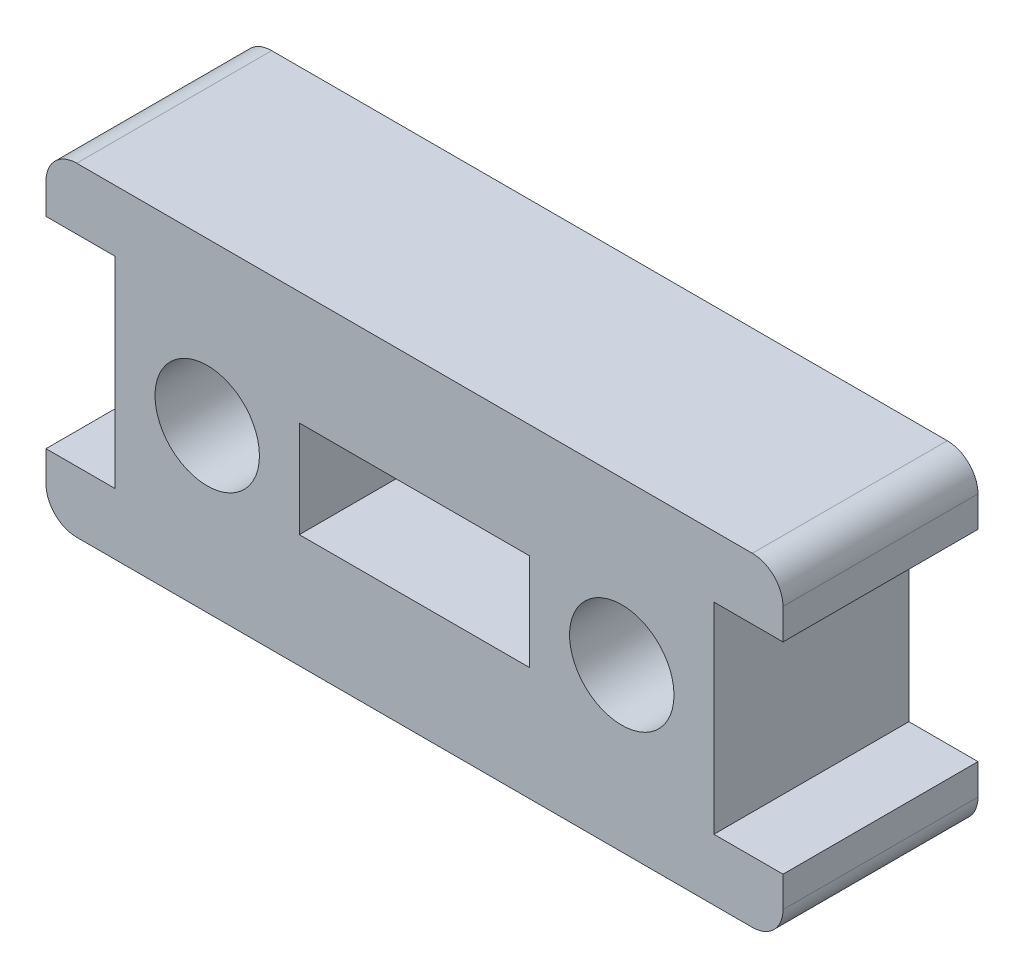
ISO-10303-21;
HEADER;
FILE_DESCRIPTION(('STEP AP214'),'2;1');
FILE_NAME('part.step','',(''),(''),'','','');
FILE_SCHEMA(('AUTOMOTIVE_DESIGN { 1 0 10303 214 1 1 1 1 }'));
ENDSEC;
DATA;
#1=APPLICATION_CONTEXT('core data for automotive mechanical design processes');
#2=APPLICATION_PROTOCOL_DEFINITION('international standard','automotive_design',2000,#1);
#3=PRODUCT_CONTEXT('',#1,'mechanical');
#4=PRODUCT('Part','Part','',(#3));
#5=PRODUCT_RELATED_PRODUCT_CATEGORY('part','',(#4));
#6=PRODUCT_DEFINITION_FORMATION('','',#4);
#7=PRODUCT_DEFINITION_CONTEXT('part definition',#1,'design');
#8=PRODUCT_DEFINITION('design','',#6,#7);
#9=PRODUCT_DEFINITION_SHAPE('','',#8);
#10=(LENGTH_UNIT() NAMED_UNIT(*) SI_UNIT(.MILLI.,.METRE.));
#11=(NAMED_UNIT(*) PLANE_ANGLE_UNIT() SI_UNIT($,.RADIAN.));
#12=(NAMED_UNIT(*) SI_UNIT($,.STERADIAN.) SOLID_ANGLE_UNIT());
#13=UNCERTAINTY_MEASURE_WITH_UNIT(LENGTH_MEASURE(1.E-05),#10,'distance_accuracy_value','');
#14=(GEOMETRIC_REPRESENTATION_CONTEXT(3) GLOBAL_UNCERTAINTY_ASSIGNED_CONTEXT((#13)) GLOBAL_UNIT_ASSIGNED_CONTEXT((#10,
#11,#12)) REPRESENTATION_CONTEXT('',''));
#15=CARTESIAN_POINT('',(0.,0.,0.));
#16=DIRECTION('',(0.,0.,1.));
#17=DIRECTION('',(1.,0.,0.));
#18=AXIS2_PLACEMENT_3D('',#15,#16,#17);
#19=CARTESIAN_POINT('',(0.,0.,6.35));
#20=DIRECTION('',(0.,0.,-1.));
#21=DIRECTION('',(-1.,0.,0.));
#22=AXIS2_PLACEMENT_3D('',#19,#20,#21);
#23=PLANE('',#22);
#24=CARTESIAN_POINT('',(-6.75,0.,6.35));
#25=DIRECTION('',(0.,0.,1.));
#26=DIRECTION('',(1.,0.,0.));
#27=AXIS2_PLACEMENT_3D('',#24,#25,#26);
#28=CIRCLE('',#27,1.7);
#29=CARTESIAN_POINT('',(-5.05,0.,6.35));
#30=VERTEX_POINT('',#29);
#31=EDGE_CURVE('E557',#30,#30,#28,.T.);
#32=ORIENTED_EDGE('',*,*,#31,.F.);
#33=EDGE_LOOP('',(#32));
#34=FACE_BOUND('',#33,.T.);
#35=CARTESIAN_POINT('',(6.75,0.,6.35));
#36=DIRECTION('',(0.,0.,1.));
#37=DIRECTION('',(1.,0.,0.));
#38=AXIS2_PLACEMENT_3D('',#35,#36,#37);
#39=CIRCLE('',#38,1.7);
#40=CARTESIAN_POINT('',(8.45,0.,6.35));
#41=VERTEX_POINT('',#40);
#42=EDGE_CURVE('E559',#41,#41,#39,.T.);
#43=ORIENTED_EDGE('',*,*,#42,.F.);
#44=EDGE_LOOP('',(#43));
#45=FACE_BOUND('',#44,.T.);
#46=DIRECTION('',(0.,-1.,0.));
#47=VECTOR('',#46,1.);
#48=CARTESIAN_POINT('',(-12.,-3.275,6.35));
#49=LINE('',#48,#47);
#50=CARTESIAN_POINT('',(-12.,-3.275,6.35));
#51=VERTEX_POINT('',#50);
#52=CARTESIAN_POINT('',(-12.,-4.275,6.35));
#53=VERTEX_POINT('',#52);
#54=EDGE_CURVE('E222',#51,#53,#49,.T.);
#55=ORIENTED_EDGE('',*,*,#54,.T.);
#56=CARTESIAN_POINT('',(-11.,-4.275,6.35));
#57=DIRECTION('',(0.,0.,-1.));
#58=DIRECTION('',(-1.,0.,0.));
#59=AXIS2_PLACEMENT_3D('',#56,#57,#58);
#60=CIRCLE('',#59,1.);
#61=CARTESIAN_POINT('',(-11.,-5.275,6.35));
#62=VERTEX_POINT('',#61);
#63=EDGE_CURVE('E315',#53,#62,#60,.F.);
#64=ORIENTED_EDGE('',*,*,#63,.T.);
#65=DIRECTION('',(1.,0.,0.));
#66=VECTOR('',#65,1.);
#67=CARTESIAN_POINT('',(-12.,-5.275,6.35));
#68=LINE('',#67,#66);
#69=CARTESIAN_POINT('',(11.,-5.275,6.35));
#70=VERTEX_POINT('',#69);
#71=EDGE_CURVE('E225',#62,#70,#68,.T.);
#72=ORIENTED_EDGE('',*,*,#71,.T.);
#73=CARTESIAN_POINT('',(11.,-4.275,6.35));
#74=DIRECTION('',(0.,0.,-1.));
#75=DIRECTION('',(-1.,0.,0.));
#76=AXIS2_PLACEMENT_3D('',#73,#74,#75);
#77=CIRCLE('',#76,1.);
#78=CARTESIAN_POINT('',(12.,-4.275,6.35));
#79=VERTEX_POINT('',#78);
#80=EDGE_CURVE('E313',#70,#79,#77,.F.);
#81=ORIENTED_EDGE('',*,*,#80,.T.);
#82=DIRECTION('',(0.,1.,0.));
#83=VECTOR('',#82,1.);
#84=CARTESIAN_POINT('',(12.,-3.275,6.35));
#85=LINE('',#84,#83);
#86=CARTESIAN_POINT('',(12.,-3.275,6.35));
#87=VERTEX_POINT('',#86);
#88=EDGE_CURVE('E228',#79,#87,#85,.T.);
#89=ORIENTED_EDGE('',*,*,#88,.T.);
#90=DIRECTION('',(-1.,0.,0.));
#91=VECTOR('',#90,1.);
#92=CARTESIAN_POINT('',(9.75,-3.275,6.35));
#93=LINE('',#92,#91);
#94=CARTESIAN_POINT('',(9.75,-3.275,6.35));
#95=VERTEX_POINT('',#94);
#96=EDGE_CURVE('E230',#87,#95,#93,.T.);
#97=ORIENTED_EDGE('',*,*,#96,.T.);
#98=DIRECTION('',(0.,1.,0.));
#99=VECTOR('',#98,1.);
#100=CARTESIAN_POINT('',(9.75,3.275,6.35));
#101=LINE('',#100,#99);
#102=CARTESIAN_POINT('',(9.75,3.275,6.35));
#103=VERTEX_POINT('',#102);
#104=EDGE_CURVE('E232',#95,#103,#101,.T.);
#105=ORIENTED_EDGE('',*,*,#104,.T.);
#106=DIRECTION('',(1.,0.,0.));
#107=VECTOR('',#106,1.);
#108=CARTESIAN_POINT('',(12.,3.275,6.35));
#109=LINE('',#108,#107);
#110=CARTESIAN_POINT('',(12.,3.275,6.35));
#111=VERTEX_POINT('',#110);
#112=EDGE_CURVE('E234',#103,#111,#109,.T.);
#113=ORIENTED_EDGE('',*,*,#112,.T.);
#114=DIRECTION('',(0.,1.,0.));
#115=VECTOR('',#114,1.);
#116=CARTESIAN_POINT('',(12.,3.275,6.35));
#117=LINE('',#116,#115);
#118=CARTESIAN_POINT('',(12.,4.275,6.35));
#119=VERTEX_POINT('',#118);
#120=EDGE_CURVE('E236',#111,#119,#117,.T.);
#121=ORIENTED_EDGE('',*,*,#120,.T.);
#122=CARTESIAN_POINT('',(11.,4.275,6.35));
#123=DIRECTION('',(0.,0.,-1.));
#124=DIRECTION('',(-1.,0.,0.));
#125=AXIS2_PLACEMENT_3D('',#122,#123,#124);
#126=CIRCLE('',#125,1.);
#127=CARTESIAN_POINT('',(11.,5.275,6.35));
#128=VERTEX_POINT('',#127);
#129=EDGE_CURVE('E311',#119,#128,#126,.F.);
#130=ORIENTED_EDGE('',*,*,#129,.T.);
#131=DIRECTION('',(-1.,0.,0.));
#132=VECTOR('',#131,1.);
#133=CARTESIAN_POINT('',(-12.,5.275,6.35));
#134=LINE('',#133,#132);
#135=CARTESIAN_POINT('',(-11.,5.275,6.35));
#136=VERTEX_POINT('',#135);
#137=EDGE_CURVE('E239',#128,#136,#134,.T.);
#138=ORIENTED_EDGE('',*,*,#137,.T.);
#139=CARTESIAN_POINT('',(-11.,4.275,6.35));
#140=DIRECTION('',(0.,0.,-1.));
#141=DIRECTION('',(-1.,0.,0.));
#142=AXIS2_PLACEMENT_3D('',#139,#140,#141);
#143=CIRCLE('',#142,1.);
#144=CARTESIAN_POINT('',(-12.,4.275,6.35));
#145=VERTEX_POINT('',#144);
#146=EDGE_CURVE('E48',#136,#145,#143,.F.);
#147=ORIENTED_EDGE('',*,*,#146,.T.);
#148=DIRECTION('',(0.,-1.,0.));
#149=VECTOR('',#148,1.);
#150=CARTESIAN_POINT('',(-12.,3.275,6.35));
#151=LINE('',#150,#149);
#152=CARTESIAN_POINT('',(-12.,3.275,6.35));
#153=VERTEX_POINT('',#152);
#154=EDGE_CURVE('E241',#145,#153,#151,.T.);
#155=ORIENTED_EDGE('',*,*,#154,.T.);
#156=DIRECTION('',(1.,0.,0.));
#157=VECTOR('',#156,1.);
#158=CARTESIAN_POINT('',(-12.,3.275,6.35));
#159=LINE('',#158,#157);
#160=CARTESIAN_POINT('',(-9.75,3.275,6.35));
#161=VERTEX_POINT('',#160);
#162=EDGE_CURVE('E243',#153,#161,#159,.T.);
#163=ORIENTED_EDGE('',*,*,#162,.T.);
#164=DIRECTION('',(0.,-1.,0.));
#165=VECTOR('',#164,1.);
#166=CARTESIAN_POINT('',(-9.75,3.275,6.35));
#167=LINE('',#166,#165);
#168=CARTESIAN_POINT('',(-9.75,-3.275,6.35));
#169=VERTEX_POINT('',#168);
#170=EDGE_CURVE('E216',#161,#169,#167,.T.);
#171=ORIENTED_EDGE('',*,*,#170,.T.);
#172=DIRECTION('',(-1.,0.,0.));
#173=VECTOR('',#172,1.);
#174=CARTESIAN_POINT('',(-9.75,-3.275,6.35));
#175=LINE('',#174,#173);
#176=EDGE_CURVE('E219',#169,#51,#175,.T.);
#177=ORIENTED_EDGE('',*,*,#176,.T.);
#178=EDGE_LOOP('',(#55,#64,#72,#81,#89,#97,#105,#113,#121,#130,#138,#147,#155,#163,#171,#177));
#179=FACE_BOUND('',#178,.T.);
#180=DIRECTION('',(0.,-1.,0.));
#181=VECTOR('',#180,1.);
#182=CARTESIAN_POINT('',(-3.75,-1.575,6.35));
#183=LINE('',#182,#181);
#184=CARTESIAN_POINT('',(-3.75,1.575,6.35));
#185=VERTEX_POINT('',#184);
#186=CARTESIAN_POINT('',(-3.75,-1.575,6.35));
#187=VERTEX_POINT('',#186);
#188=EDGE_CURVE('E173',#185,#187,#183,.T.);
#189=ORIENTED_EDGE('',*,*,#188,.F.);
#190=DIRECTION('',(-1.,0.,0.));
#191=VECTOR('',#190,1.);
#192=CARTESIAN_POINT('',(3.75,1.575,6.35));
#193=LINE('',#192,#191);
#194=CARTESIAN_POINT('',(3.75,1.575,6.35));
#195=VERTEX_POINT('',#194);
#196=EDGE_CURVE('E198',#195,#185,#193,.T.);
#197=ORIENTED_EDGE('',*,*,#196,.F.);
#198=DIRECTION('',(0.,1.,0.));
#199=VECTOR('',#198,1.);
#200=CARTESIAN_POINT('',(3.75,-1.575,6.35));
#201=LINE('',#200,#199);
#202=CARTESIAN_POINT('',(3.75,-1.575,6.35));
#203=VERTEX_POINT('',#202);
#204=EDGE_CURVE('E196',#203,#195,#201,.T.);
#205=ORIENTED_EDGE('',*,*,#204,.F.);
#206=DIRECTION('',(1.,0.,0.));
#207=VECTOR('',#206,1.);
#208=CARTESIAN_POINT('',(3.75,-1.575,6.35));
#209=LINE('',#208,#207);
#210=EDGE_CURVE('E183',#187,#203,#209,.T.);
#211=ORIENTED_EDGE('',*,*,#210,.F.);
#212=EDGE_LOOP('',(#189,#197,#205,#211));
#213=FACE_BOUND('',#212,.T.);
#214=ADVANCED_FACE('F33',(#34,#45,#179,#213),#23,.F.);
#215=CARTESIAN_POINT('',(0.,0.,0.));
#216=DIRECTION('',(0.,0.,-1.));
#217=DIRECTION('',(-1.,0.,0.));
#218=AXIS2_PLACEMENT_3D('',#215,#216,#217);
#219=PLANE('',#218);
#220=CARTESIAN_POINT('',(-6.75,0.,0.));
#221=DIRECTION('',(0.,0.,1.));
#222=DIRECTION('',(1.,0.,0.));
#223=AXIS2_PLACEMENT_3D('',#220,#221,#222);
#224=CIRCLE('',#223,1.7);
#225=CARTESIAN_POINT('',(-5.05,0.,0.));
#226=VERTEX_POINT('',#225);
#227=EDGE_CURVE('E555',#226,#226,#224,.T.);
#228=ORIENTED_EDGE('',*,*,#227,.T.);
#229=EDGE_LOOP('',(#228));
#230=FACE_BOUND('',#229,.T.);
#231=CARTESIAN_POINT('',(6.75,0.,0.));
#232=DIRECTION('',(0.,0.,1.));
#233=DIRECTION('',(1.,0.,0.));
#234=AXIS2_PLACEMENT_3D('',#231,#232,#233);
#235=CIRCLE('',#234,1.7);
#236=CARTESIAN_POINT('',(8.45,0.,0.));
#237=VERTEX_POINT('',#236);
#238=EDGE_CURVE('E205',#237,#237,#235,.T.);
#239=ORIENTED_EDGE('',*,*,#238,.T.);
#240=EDGE_LOOP('',(#239));
#241=FACE_BOUND('',#240,.T.);
#242=DIRECTION('',(1.,0.,0.));
#243=VECTOR('',#242,1.);
#244=CARTESIAN_POINT('',(-12.,-5.275,0.));
#245=LINE('',#244,#243);
#246=CARTESIAN_POINT('',(-11.,-5.275,0.));
#247=VERTEX_POINT('',#246);
#248=CARTESIAN_POINT('',(11.,-5.275,0.));
#249=VERTEX_POINT('',#248);
#250=EDGE_CURVE('E253',#247,#249,#245,.T.);
#251=ORIENTED_EDGE('',*,*,#250,.F.);
#252=CARTESIAN_POINT('',(-11.,-4.275,0.));
#253=DIRECTION('',(0.,0.,-1.));
#254=DIRECTION('',(-1.,0.,0.));
#255=AXIS2_PLACEMENT_3D('',#252,#253,#254);
#256=CIRCLE('',#255,1.);
#257=CARTESIAN_POINT('',(-12.,-4.275,0.));
#258=VERTEX_POINT('',#257);
#259=EDGE_CURVE('E306',#247,#258,#256,.T.);
#260=ORIENTED_EDGE('',*,*,#259,.T.);
#261=DIRECTION('',(0.,-1.,0.));
#262=VECTOR('',#261,1.);
#263=CARTESIAN_POINT('',(-12.,-3.275,0.));
#264=LINE('',#263,#262);
#265=CARTESIAN_POINT('',(-12.,-3.275,0.));
#266=VERTEX_POINT('',#265);
#267=EDGE_CURVE('E250',#266,#258,#264,.T.);
#268=ORIENTED_EDGE('',*,*,#267,.F.);
#269=DIRECTION('',(-1.,0.,0.));
#270=VECTOR('',#269,1.);
#271=CARTESIAN_POINT('',(-9.75,-3.275,0.));
#272=LINE('',#271,#270);
#273=CARTESIAN_POINT('',(-9.75,-3.275,0.));
#274=VERTEX_POINT('',#273);
#275=EDGE_CURVE('E248',#274,#266,#272,.T.);
#276=ORIENTED_EDGE('',*,*,#275,.F.);
#277=DIRECTION('',(0.,-1.,0.));
#278=VECTOR('',#277,1.);
#279=CARTESIAN_POINT('',(-9.75,3.275,0.));
#280=LINE('',#279,#278);
#281=CARTESIAN_POINT('',(-9.75,3.275,0.));
#282=VERTEX_POINT('',#281);
#283=EDGE_CURVE('E191',#282,#274,#280,.T.);
#284=ORIENTED_EDGE('',*,*,#283,.F.);
#285=DIRECTION('',(1.,0.,0.));
#286=VECTOR('',#285,1.);
#287=CARTESIAN_POINT('',(-12.,3.275,0.));
#288=LINE('',#287,#286);
#289=CARTESIAN_POINT('',(-12.,3.275,0.));
#290=VERTEX_POINT('',#289);
#291=EDGE_CURVE('E220',#290,#282,#288,.T.);
#292=ORIENTED_EDGE('',*,*,#291,.F.);
#293=DIRECTION('',(0.,-1.,0.));
#294=VECTOR('',#293,1.);
#295=CARTESIAN_POINT('',(-12.,3.275,0.));
#296=LINE('',#295,#294);
#297=CARTESIAN_POINT('',(-12.,4.275,0.));
#298=VERTEX_POINT('',#297);
#299=EDGE_CURVE('E269',#298,#290,#296,.T.);
#300=ORIENTED_EDGE('',*,*,#299,.F.);
#301=CARTESIAN_POINT('',(-11.,4.275,0.));
#302=DIRECTION('',(0.,0.,-1.));
#303=DIRECTION('',(-1.,0.,0.));
#304=AXIS2_PLACEMENT_3D('',#301,#302,#303);
#305=CIRCLE('',#304,1.);
#306=CARTESIAN_POINT('',(-11.,5.275,0.));
#307=VERTEX_POINT('',#306);
#308=EDGE_CURVE('E300',#298,#307,#305,.T.);
#309=ORIENTED_EDGE('',*,*,#308,.T.);
#310=DIRECTION('',(-1.,0.,0.));
#311=VECTOR('',#310,1.);
#312=CARTESIAN_POINT('',(-12.,5.275,0.));
#313=LINE('',#312,#311);
#314=CARTESIAN_POINT('',(11.,5.275,0.));
#315=VERTEX_POINT('',#314);
#316=EDGE_CURVE('E267',#315,#307,#313,.T.);
#317=ORIENTED_EDGE('',*,*,#316,.F.);
#318=CARTESIAN_POINT('',(11.,4.275,0.));
#319=DIRECTION('',(0.,0.,-1.));
#320=DIRECTION('',(-1.,0.,0.));
#321=AXIS2_PLACEMENT_3D('',#318,#319,#320);
#322=CIRCLE('',#321,1.);
#323=CARTESIAN_POINT('',(12.,4.275,0.));
#324=VERTEX_POINT('',#323);
#325=EDGE_CURVE('E302',#315,#324,#322,.T.);
#326=ORIENTED_EDGE('',*,*,#325,.T.);
#327=DIRECTION('',(0.,1.,0.));
#328=VECTOR('',#327,1.);
#329=CARTESIAN_POINT('',(12.,3.275,0.));
#330=LINE('',#329,#328);
#331=CARTESIAN_POINT('',(12.,3.275,0.));
#332=VERTEX_POINT('',#331);
#333=EDGE_CURVE('E264',#332,#324,#330,.T.);
#334=ORIENTED_EDGE('',*,*,#333,.F.);
#335=DIRECTION('',(1.,0.,0.));
#336=VECTOR('',#335,1.);
#337=CARTESIAN_POINT('',(12.,3.275,0.));
#338=LINE('',#337,#336);
#339=CARTESIAN_POINT('',(9.75,3.275,0.));
#340=VERTEX_POINT('',#339);
#341=EDGE_CURVE('E262',#340,#332,#338,.T.);
#342=ORIENTED_EDGE('',*,*,#341,.F.);
#343=DIRECTION('',(0.,1.,0.));
#344=VECTOR('',#343,1.);
#345=CARTESIAN_POINT('',(9.75,3.275,0.));
#346=LINE('',#345,#344);
#347=CARTESIAN_POINT('',(9.75,-3.275,0.));
#348=VERTEX_POINT('',#347);
#349=EDGE_CURVE('E260',#348,#340,#346,.T.);
#350=ORIENTED_EDGE('',*,*,#349,.F.);
#351=DIRECTION('',(-1.,0.,0.));
#352=VECTOR('',#351,1.);
#353=CARTESIAN_POINT('',(9.75,-3.275,0.));
#354=LINE('',#353,#352);
#355=CARTESIAN_POINT('',(12.,-3.275,0.));
#356=VERTEX_POINT('',#355);
#357=EDGE_CURVE('E258',#356,#348,#354,.T.);
#358=ORIENTED_EDGE('',*,*,#357,.F.);
#359=DIRECTION('',(0.,1.,0.));
#360=VECTOR('',#359,1.);
#361=CARTESIAN_POINT('',(12.,-3.275,0.));
#362=LINE('',#361,#360);
#363=CARTESIAN_POINT('',(12.,-4.275,0.));
#364=VERTEX_POINT('',#363);
#365=EDGE_CURVE('E256',#364,#356,#362,.T.);
#366=ORIENTED_EDGE('',*,*,#365,.F.);
#367=CARTESIAN_POINT('',(11.,-4.275,0.));
#368=DIRECTION('',(0.,0.,-1.));
#369=DIRECTION('',(-1.,0.,0.));
#370=AXIS2_PLACEMENT_3D('',#367,#368,#369);
#371=CIRCLE('',#370,1.);
#372=EDGE_CURVE('E304',#364,#249,#371,.T.);
#373=ORIENTED_EDGE('',*,*,#372,.T.);
#374=EDGE_LOOP('',(#251,#260,#268,#276,#284,#292,#300,#309,#317,#326,#334,#342,#350,#358,#366,#373));
#375=FACE_BOUND('',#374,.T.);
#376=DIRECTION('',(-1.,0.,0.));
#377=VECTOR('',#376,1.);
#378=CARTESIAN_POINT('',(3.75,1.575,0.));
#379=LINE('',#378,#377);
#380=CARTESIAN_POINT('',(3.75,1.575,0.));
#381=VERTEX_POINT('',#380);
#382=CARTESIAN_POINT('',(-3.75,1.575,0.));
#383=VERTEX_POINT('',#382);
#384=EDGE_CURVE('E184',#381,#383,#379,.T.);
#385=ORIENTED_EDGE('',*,*,#384,.T.);
#386=DIRECTION('',(0.,-1.,0.));
#387=VECTOR('',#386,1.);
#388=CARTESIAN_POINT('',(-3.75,-1.575,0.));
#389=LINE('',#388,#387);
#390=CARTESIAN_POINT('',(-3.75,-1.575,0.));
#391=VERTEX_POINT('',#390);
#392=EDGE_CURVE('E203',#383,#391,#389,.T.);
#393=ORIENTED_EDGE('',*,*,#392,.T.);
#394=DIRECTION('',(1.,0.,0.));
#395=VECTOR('',#394,1.);
#396=CARTESIAN_POINT('',(3.75,-1.575,0.));
#397=LINE('',#396,#395);
#398=CARTESIAN_POINT('',(3.75,-1.575,0.));
#399=VERTEX_POINT('',#398);
#400=EDGE_CURVE('E190',#391,#399,#397,.T.);
#401=ORIENTED_EDGE('',*,*,#400,.T.);
#402=DIRECTION('',(0.,1.,0.));
#403=VECTOR('',#402,1.);
#404=CARTESIAN_POINT('',(3.75,-1.575,0.));
#405=LINE('',#404,#403);
#406=EDGE_CURVE('E207',#399,#381,#405,.T.);
#407=ORIENTED_EDGE('',*,*,#406,.T.);
#408=EDGE_LOOP('',(#385,#393,#401,#407));
#409=FACE_BOUND('',#408,.T.);
#410=ADVANCED_FACE('F338',(#230,#241,#375,#409),#219,.T.);
#411=CARTESIAN_POINT('',(-9.75,3.275,6.35));
#412=DIRECTION('',(1.,0.,0.));
#413=DIRECTION('',(0.,0.,-1.));
#414=AXIS2_PLACEMENT_3D('',#411,#412,#413);
#415=PLANE('',#414);
#416=ORIENTED_EDGE('',*,*,#283,.T.);
#417=DIRECTION('',(0.,0.,-1.));
#418=VECTOR('',#417,1.);
#419=CARTESIAN_POINT('',(-9.75,-3.275,6.35));
#420=LINE('',#419,#418);
#421=EDGE_CURVE('E292',#169,#274,#420,.T.);
#422=ORIENTED_EDGE('',*,*,#421,.F.);
#423=ORIENTED_EDGE('',*,*,#170,.F.);
#424=DIRECTION('',(0.,0.,-1.));
#425=VECTOR('',#424,1.);
#426=CARTESIAN_POINT('',(-9.75,3.275,6.35));
#427=LINE('',#426,#425);
#428=EDGE_CURVE('E245',#161,#282,#427,.T.);
#429=ORIENTED_EDGE('',*,*,#428,.T.);
#430=EDGE_LOOP('',(#416,#422,#423,#429));
#431=FACE_BOUND('',#430,.T.);
#432=ADVANCED_FACE('F355',(#431),#415,.F.);
#433=CARTESIAN_POINT('',(-9.75,-3.275,6.35));
#434=DIRECTION('',(0.,-1.,0.));
#435=DIRECTION('',(1.,0.,0.));
#436=AXIS2_PLACEMENT_3D('',#433,#434,#435);
#437=PLANE('',#436);
#438=ORIENTED_EDGE('',*,*,#275,.T.);
#439=DIRECTION('',(0.,0.,-1.));
#440=VECTOR('',#439,1.);
#441=CARTESIAN_POINT('',(-12.,-3.275,6.35));
#442=LINE('',#441,#440);
#443=EDGE_CURVE('E289',#51,#266,#442,.T.);
#444=ORIENTED_EDGE('',*,*,#443,.F.);
#445=ORIENTED_EDGE('',*,*,#176,.F.);
#446=ORIENTED_EDGE('',*,*,#421,.T.);
#447=EDGE_LOOP('',(#438,#444,#445,#446));
#448=FACE_BOUND('',#447,.T.);
#449=ADVANCED_FACE('F357',(#448),#437,.F.);
#450=CARTESIAN_POINT('',(-12.,-3.275,6.35));
#451=DIRECTION('',(1.,0.,0.));
#452=DIRECTION('',(0.,1.,0.));
#453=AXIS2_PLACEMENT_3D('',#450,#451,#452);
#454=PLANE('',#453);
#455=ORIENTED_EDGE('',*,*,#267,.T.);
#456=DIRECTION('',(0.,0.,-1.));
#457=VECTOR('',#456,1.);
#458=CARTESIAN_POINT('',(-12.,-4.275,6.35));
#459=LINE('',#458,#457);
#460=EDGE_CURVE('E308',#258,#53,#459,.F.);
#461=ORIENTED_EDGE('',*,*,#460,.T.);
#462=ORIENTED_EDGE('',*,*,#54,.F.);
#463=ORIENTED_EDGE('',*,*,#443,.T.);
#464=EDGE_LOOP('',(#455,#461,#462,#463));
#465=FACE_BOUND('',#464,.T.);
#466=ADVANCED_FACE('F469',(#465),#454,.F.);
#467=CARTESIAN_POINT('',(-12.,-5.275,6.35));
#468=DIRECTION('',(0.,1.,0.));
#469=DIRECTION('',(-1.,0.,0.));
#470=AXIS2_PLACEMENT_3D('',#467,#468,#469);
#471=PLANE('',#470);
#472=ORIENTED_EDGE('',*,*,#71,.F.);
#473=DIRECTION('',(0.,0.,-1.));
#474=VECTOR('',#473,1.);
#475=CARTESIAN_POINT('',(-11.,-5.275,6.35));
#476=LINE('',#475,#474);
#477=EDGE_CURVE('E297',#62,#247,#476,.T.);
#478=ORIENTED_EDGE('',*,*,#477,.T.);
#479=ORIENTED_EDGE('',*,*,#250,.T.);
#480=DIRECTION('',(0.,0.,-1.));
#481=VECTOR('',#480,1.);
#482=CARTESIAN_POINT('',(11.,-5.275,6.35));
#483=LINE('',#482,#481);
#484=EDGE_CURVE('E295',#249,#70,#483,.F.);
#485=ORIENTED_EDGE('',*,*,#484,.T.);
#486=EDGE_LOOP('',(#472,#478,#479,#485));
#487=FACE_BOUND('',#486,.T.);
#488=ADVANCED_FACE('F368',(#487),#471,.F.);
#489=CARTESIAN_POINT('',(12.,-3.275,6.35));
#490=DIRECTION('',(-1.,0.,0.));
#491=DIRECTION('',(0.,0.,1.));
#492=AXIS2_PLACEMENT_3D('',#489,#490,#491);
#493=PLANE('',#492);
#494=ORIENTED_EDGE('',*,*,#88,.F.);
#495=DIRECTION('',(0.,0.,-1.));
#496=VECTOR('',#495,1.);
#497=CARTESIAN_POINT('',(12.,-4.275,6.35));
#498=LINE('',#497,#496);
#499=EDGE_CURVE('E317',#79,#364,#498,.T.);
#500=ORIENTED_EDGE('',*,*,#499,.T.);
#501=ORIENTED_EDGE('',*,*,#365,.T.);
#502=DIRECTION('',(0.,0.,-1.));
#503=VECTOR('',#502,1.);
#504=CARTESIAN_POINT('',(12.,-3.275,6.35));
#505=LINE('',#504,#503);
#506=EDGE_CURVE('E286',#87,#356,#505,.T.);
#507=ORIENTED_EDGE('',*,*,#506,.F.);
#508=EDGE_LOOP('',(#494,#500,#501,#507));
#509=FACE_BOUND('',#508,.T.);
#510=ADVANCED_FACE('F379',(#509),#493,.F.);
#511=CARTESIAN_POINT('',(9.75,-3.275,6.35));
#512=DIRECTION('',(0.,-1.,0.));
#513=DIRECTION('',(1.,0.,0.));
#514=AXIS2_PLACEMENT_3D('',#511,#512,#513);
#515=PLANE('',#514);
#516=ORIENTED_EDGE('',*,*,#357,.T.);
#517=DIRECTION('',(0.,0.,-1.));
#518=VECTOR('',#517,1.);
#519=CARTESIAN_POINT('',(9.75,-3.275,6.35));
#520=LINE('',#519,#518);
#521=EDGE_CURVE('E283',#95,#348,#520,.T.);
#522=ORIENTED_EDGE('',*,*,#521,.F.);
#523=ORIENTED_EDGE('',*,*,#96,.F.);
#524=ORIENTED_EDGE('',*,*,#506,.T.);
#525=EDGE_LOOP('',(#516,#522,#523,#524));
#526=FACE_BOUND('',#525,.T.);
#527=ADVANCED_FACE('F386',(#526),#515,.F.);
#528=CARTESIAN_POINT('',(9.75,3.275,6.35));
#529=DIRECTION('',(-1.,0.,0.));
#530=DIRECTION('',(0.,0.,1.));
#531=AXIS2_PLACEMENT_3D('',#528,#529,#530);
#532=PLANE('',#531);
#533=ORIENTED_EDGE('',*,*,#349,.T.);
#534=DIRECTION('',(0.,0.,-1.));
#535=VECTOR('',#534,1.);
#536=CARTESIAN_POINT('',(9.75,3.275,6.35));
#537=LINE('',#536,#535);
#538=EDGE_CURVE('E280',#103,#340,#537,.T.);
#539=ORIENTED_EDGE('',*,*,#538,.F.);
#540=ORIENTED_EDGE('',*,*,#104,.F.);
#541=ORIENTED_EDGE('',*,*,#521,.T.);
#542=EDGE_LOOP('',(#533,#539,#540,#541));
#543=FACE_BOUND('',#542,.T.);
#544=ADVANCED_FACE('F389',(#543),#532,.F.);
#545=CARTESIAN_POINT('',(12.,3.275,6.35));
#546=DIRECTION('',(0.,1.,0.));
#547=DIRECTION('',(0.,0.,1.));
#548=AXIS2_PLACEMENT_3D('',#545,#546,#547);
#549=PLANE('',#548);
#550=ORIENTED_EDGE('',*,*,#341,.T.);
#551=DIRECTION('',(0.,0.,-1.));
#552=VECTOR('',#551,1.);
#553=CARTESIAN_POINT('',(12.,3.275,6.35));
#554=LINE('',#553,#552);
#555=EDGE_CURVE('E277',#111,#332,#554,.T.);
#556=ORIENTED_EDGE('',*,*,#555,.F.);
#557=ORIENTED_EDGE('',*,*,#112,.F.);
#558=ORIENTED_EDGE('',*,*,#538,.T.);
#559=EDGE_LOOP('',(#550,#556,#557,#558));
#560=FACE_BOUND('',#559,.T.);
#561=ADVANCED_FACE('F392',(#560),#549,.F.);
#562=CARTESIAN_POINT('',(12.,3.275,6.35));
#563=DIRECTION('',(-1.,0.,0.));
#564=DIRECTION('',(0.,-1.,0.));
#565=AXIS2_PLACEMENT_3D('',#562,#563,#564);
#566=PLANE('',#565);
#567=ORIENTED_EDGE('',*,*,#333,.T.);
#568=DIRECTION('',(0.,0.,-1.));
#569=VECTOR('',#568,1.);
#570=CARTESIAN_POINT('',(12.,4.275,6.35));
#571=LINE('',#570,#569);
#572=EDGE_CURVE('E41',#324,#119,#571,.F.);
#573=ORIENTED_EDGE('',*,*,#572,.T.);
#574=ORIENTED_EDGE('',*,*,#120,.F.);
#575=ORIENTED_EDGE('',*,*,#555,.T.);
#576=EDGE_LOOP('',(#567,#573,#574,#575));
#577=FACE_BOUND('',#576,.T.);
#578=ADVANCED_FACE('F326',(#577),#566,.F.);
#579=CARTESIAN_POINT('',(-12.,5.275,6.35));
#580=DIRECTION('',(0.,-1.,0.));
#581=DIRECTION('',(0.,0.,-1.));
#582=AXIS2_PLACEMENT_3D('',#579,#580,#581);
#583=PLANE('',#582);
#584=ORIENTED_EDGE('',*,*,#137,.F.);
#585=DIRECTION('',(0.,0.,-1.));
#586=VECTOR('',#585,1.);
#587=CARTESIAN_POINT('',(11.,5.275,6.35));
#588=LINE('',#587,#586);
#589=EDGE_CURVE('E321',#128,#315,#588,.T.);
#590=ORIENTED_EDGE('',*,*,#589,.T.);
#591=ORIENTED_EDGE('',*,*,#316,.T.);
#592=DIRECTION('',(0.,0.,-1.));
#593=VECTOR('',#592,1.);
#594=CARTESIAN_POINT('',(-11.,5.275,6.35));
#595=LINE('',#594,#593);
#596=EDGE_CURVE('E56',#307,#136,#595,.F.);
#597=ORIENTED_EDGE('',*,*,#596,.T.);
#598=EDGE_LOOP('',(#584,#590,#591,#597));
#599=FACE_BOUND('',#598,.T.);
#600=ADVANCED_FACE('F335',(#599),#583,.F.);
#601=CARTESIAN_POINT('',(-12.,3.275,6.35));
#602=DIRECTION('',(1.,0.,0.));
#603=DIRECTION('',(0.,1.,0.));
#604=AXIS2_PLACEMENT_3D('',#601,#602,#603);
#605=PLANE('',#604);
#606=ORIENTED_EDGE('',*,*,#154,.F.);
#607=DIRECTION('',(0.,0.,-1.));
#608=VECTOR('',#607,1.);
#609=CARTESIAN_POINT('',(-12.,4.275,6.35));
#610=LINE('',#609,#608);
#611=EDGE_CURVE('E11',#145,#298,#610,.T.);
#612=ORIENTED_EDGE('',*,*,#611,.T.);
#613=ORIENTED_EDGE('',*,*,#299,.T.);
#614=DIRECTION('',(0.,0.,-1.));
#615=VECTOR('',#614,1.);
#616=CARTESIAN_POINT('',(-12.,3.275,6.35));
#617=LINE('',#616,#615);
#618=EDGE_CURVE('E274',#153,#290,#617,.T.);
#619=ORIENTED_EDGE('',*,*,#618,.F.);
#620=EDGE_LOOP('',(#606,#612,#613,#619));
#621=FACE_BOUND('',#620,.T.);
#622=ADVANCED_FACE('F345',(#621),#605,.F.);
#623=CARTESIAN_POINT('',(-12.,3.275,6.35));
#624=DIRECTION('',(0.,1.,0.));
#625=DIRECTION('',(0.,0.,1.));
#626=AXIS2_PLACEMENT_3D('',#623,#624,#625);
#627=PLANE('',#626);
#628=ORIENTED_EDGE('',*,*,#291,.T.);
#629=ORIENTED_EDGE('',*,*,#428,.F.);
#630=ORIENTED_EDGE('',*,*,#162,.F.);
#631=ORIENTED_EDGE('',*,*,#618,.T.);
#632=EDGE_LOOP('',(#628,#629,#630,#631));
#633=FACE_BOUND('',#632,.T.);
#634=ADVANCED_FACE('F352',(#633),#627,.F.);
#635=CARTESIAN_POINT('',(-3.75,-1.575,6.35));
#636=DIRECTION('',(1.,0.,0.));
#637=DIRECTION('',(0.,0.,-1.));
#638=AXIS2_PLACEMENT_3D('',#635,#636,#637);
#639=PLANE('',#638);
#640=ORIENTED_EDGE('',*,*,#392,.F.);
#641=DIRECTION('',(0.,0.,-1.));
#642=VECTOR('',#641,1.);
#643=CARTESIAN_POINT('',(-3.75,1.575,6.35));
#644=LINE('',#643,#642);
#645=EDGE_CURVE('E179',#185,#383,#644,.T.);
#646=ORIENTED_EDGE('',*,*,#645,.F.);
#647=ORIENTED_EDGE('',*,*,#188,.T.);
#648=DIRECTION('',(0.,0.,-1.));
#649=VECTOR('',#648,1.);
#650=CARTESIAN_POINT('',(-3.75,-1.575,6.35));
#651=LINE('',#650,#649);
#652=EDGE_CURVE('E176',#187,#391,#651,.T.);
#653=ORIENTED_EDGE('',*,*,#652,.T.);
#654=EDGE_LOOP('',(#640,#646,#647,#653));
#655=FACE_BOUND('',#654,.T.);
#656=ADVANCED_FACE('F175',(#655),#639,.T.);
#657=CARTESIAN_POINT('',(3.75,-1.575,6.35));
#658=DIRECTION('',(0.,1.,0.));
#659=DIRECTION('',(-1.,0.,0.));
#660=AXIS2_PLACEMENT_3D('',#657,#658,#659);
#661=PLANE('',#660);
#662=ORIENTED_EDGE('',*,*,#400,.F.);
#663=ORIENTED_EDGE('',*,*,#652,.F.);
#664=ORIENTED_EDGE('',*,*,#210,.T.);
#665=DIRECTION('',(0.,0.,-1.));
#666=VECTOR('',#665,1.);
#667=CARTESIAN_POINT('',(3.75,-1.575,6.35));
#668=LINE('',#667,#666);
#669=EDGE_CURVE('E192',#203,#399,#668,.T.);
#670=ORIENTED_EDGE('',*,*,#669,.T.);
#671=EDGE_LOOP('',(#662,#663,#664,#670));
#672=FACE_BOUND('',#671,.T.);
#673=ADVANCED_FACE('F187',(#672),#661,.T.);
#674=CARTESIAN_POINT('',(3.75,-1.575,6.35));
#675=DIRECTION('',(-1.,0.,0.));
#676=DIRECTION('',(0.,0.,1.));
#677=AXIS2_PLACEMENT_3D('',#674,#675,#676);
#678=PLANE('',#677);
#679=ORIENTED_EDGE('',*,*,#406,.F.);
#680=ORIENTED_EDGE('',*,*,#669,.F.);
#681=ORIENTED_EDGE('',*,*,#204,.T.);
#682=DIRECTION('',(0.,0.,-1.));
#683=VECTOR('',#682,1.);
#684=CARTESIAN_POINT('',(3.75,1.575,6.35));
#685=LINE('',#684,#683);
#686=EDGE_CURVE('E213',#195,#381,#685,.T.);
#687=ORIENTED_EDGE('',*,*,#686,.T.);
#688=EDGE_LOOP('',(#679,#680,#681,#687));
#689=FACE_BOUND('',#688,.T.);
#690=ADVANCED_FACE('F514',(#689),#678,.T.);
#691=CARTESIAN_POINT('',(3.75,1.575,6.35));
#692=DIRECTION('',(0.,-1.,0.));
#693=DIRECTION('',(1.,0.,0.));
#694=AXIS2_PLACEMENT_3D('',#691,#692,#693);
#695=PLANE('',#694);
#696=ORIENTED_EDGE('',*,*,#384,.F.);
#697=ORIENTED_EDGE('',*,*,#686,.F.);
#698=ORIENTED_EDGE('',*,*,#196,.T.);
#699=ORIENTED_EDGE('',*,*,#645,.T.);
#700=EDGE_LOOP('',(#696,#697,#698,#699));
#701=FACE_BOUND('',#700,.T.);
#702=ADVANCED_FACE('F522',(#701),#695,.T.);
#703=CARTESIAN_POINT('',(6.75,0.,6.35));
#704=DIRECTION('',(0.,0.,1.));
#705=DIRECTION('',(1.,0.,0.));
#706=AXIS2_PLACEMENT_3D('',#703,#704,#705);
#707=CYLINDRICAL_SURFACE('',#706,1.7);
#708=ORIENTED_EDGE('',*,*,#238,.F.);
#709=EDGE_LOOP('',(#708));
#710=FACE_BOUND('',#709,.T.);
#711=ORIENTED_EDGE('',*,*,#42,.T.);
#712=EDGE_LOOP('',(#711));
#713=FACE_BOUND('',#712,.T.);
#714=ADVANCED_FACE('F532',(#710,#713),#707,.F.);
#715=CARTESIAN_POINT('',(-6.75,0.,6.35));
#716=DIRECTION('',(0.,0.,1.));
#717=DIRECTION('',(1.,0.,0.));
#718=AXIS2_PLACEMENT_3D('',#715,#716,#717);
#719=CYLINDRICAL_SURFACE('',#718,1.7);
#720=ORIENTED_EDGE('',*,*,#227,.F.);
#721=EDGE_LOOP('',(#720));
#722=FACE_BOUND('',#721,.T.);
#723=ORIENTED_EDGE('',*,*,#31,.T.);
#724=EDGE_LOOP('',(#723));
#725=FACE_BOUND('',#724,.T.);
#726=ADVANCED_FACE('F436',(#722,#725),#719,.F.);
#727=CARTESIAN_POINT('',(-11.,-4.275,6.35));
#728=DIRECTION('',(0.,0.,-1.));
#729=DIRECTION('',(-1.,0.,0.));
#730=AXIS2_PLACEMENT_3D('',#727,#728,#729);
#731=CYLINDRICAL_SURFACE('',#730,1.);
#732=ORIENTED_EDGE('',*,*,#63,.F.);
#733=ORIENTED_EDGE('',*,*,#460,.F.);
#734=ORIENTED_EDGE('',*,*,#259,.F.);
#735=ORIENTED_EDGE('',*,*,#477,.F.);
#736=EDGE_LOOP('',(#732,#733,#734,#735));
#737=FACE_BOUND('',#736,.T.);
#738=ADVANCED_FACE('F366',(#737),#731,.T.);
#739=CARTESIAN_POINT('',(11.,-4.275,6.35));
#740=DIRECTION('',(0.,0.,-1.));
#741=DIRECTION('',(-1.,0.,0.));
#742=AXIS2_PLACEMENT_3D('',#739,#740,#741);
#743=CYLINDRICAL_SURFACE('',#742,1.);
#744=ORIENTED_EDGE('',*,*,#80,.F.);
#745=ORIENTED_EDGE('',*,*,#484,.F.);
#746=ORIENTED_EDGE('',*,*,#372,.F.);
#747=ORIENTED_EDGE('',*,*,#499,.F.);
#748=EDGE_LOOP('',(#744,#745,#746,#747));
#749=FACE_BOUND('',#748,.T.);
#750=ADVANCED_FACE('F376',(#749),#743,.T.);
#751=CARTESIAN_POINT('',(11.,4.275,6.35));
#752=DIRECTION('',(0.,0.,-1.));
#753=DIRECTION('',(-1.,0.,0.));
#754=AXIS2_PLACEMENT_3D('',#751,#752,#753);
#755=CYLINDRICAL_SURFACE('',#754,1.);
#756=ORIENTED_EDGE('',*,*,#129,.F.);
#757=ORIENTED_EDGE('',*,*,#572,.F.);
#758=ORIENTED_EDGE('',*,*,#325,.F.);
#759=ORIENTED_EDGE('',*,*,#589,.F.);
#760=EDGE_LOOP('',(#756,#757,#758,#759));
#761=FACE_BOUND('',#760,.T.);
#762=ADVANCED_FACE('F333',(#761),#755,.T.);
#763=CARTESIAN_POINT('',(-11.,4.275,6.35));
#764=DIRECTION('',(0.,0.,-1.));
#765=DIRECTION('',(-1.,0.,0.));
#766=AXIS2_PLACEMENT_3D('',#763,#764,#765);
#767=CYLINDRICAL_SURFACE('',#766,1.);
#768=ORIENTED_EDGE('',*,*,#146,.F.);
#769=ORIENTED_EDGE('',*,*,#596,.F.);
#770=ORIENTED_EDGE('',*,*,#308,.F.);
#771=ORIENTED_EDGE('',*,*,#611,.F.);
#772=EDGE_LOOP('',(#768,#769,#770,#771));
#773=FACE_BOUND('',#772,.T.);
#774=ADVANCED_FACE('F35',(#773),#767,.T.);
#775=CLOSED_SHELL('',(#214,#410,#432,#449,#466,#488,#510,#527,#544,#561,#578,#600,#622,#634,
#656,#673,#690,#702,#714,#726,#738,#750,#762,#774));
#776=MANIFOLD_SOLID_BREP('B2',#775);
#777=ADVANCED_BREP_SHAPE_REPRESENTATION('',(#18,#776),#14);
#778=SHAPE_DEFINITION_REPRESENTATION(#9,#777);
ENDSEC;
END-ISO-10303-21;
